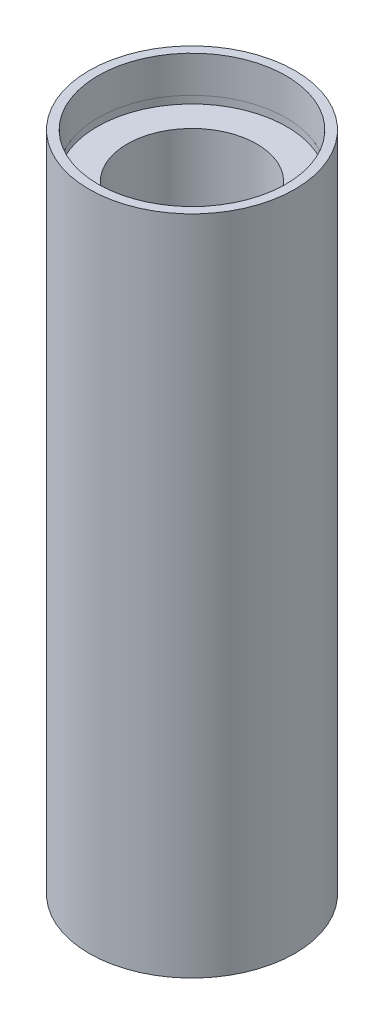
ISO-10303-21;
HEADER;
FILE_DESCRIPTION(('STEP AP214'),'2;1');
FILE_NAME('part.step','',(''),(''),'','','');
FILE_SCHEMA(('AUTOMOTIVE_DESIGN { 1 0 10303 214 1 1 1 1 }'));
ENDSEC;
DATA;
#1=APPLICATION_CONTEXT('core data for automotive mechanical design processes');
#2=APPLICATION_PROTOCOL_DEFINITION('international standard','automotive_design',2000,#1);
#3=PRODUCT_CONTEXT('',#1,'mechanical');
#4=PRODUCT('Part','Part','',(#3));
#5=PRODUCT_RELATED_PRODUCT_CATEGORY('part','',(#4));
#6=PRODUCT_DEFINITION_FORMATION('','',#4);
#7=PRODUCT_DEFINITION_CONTEXT('part definition',#1,'design');
#8=PRODUCT_DEFINITION('design','',#6,#7);
#9=PRODUCT_DEFINITION_SHAPE('','',#8);
#10=(LENGTH_UNIT() NAMED_UNIT(*) SI_UNIT(.MILLI.,.METRE.));
#11=(NAMED_UNIT(*) PLANE_ANGLE_UNIT() SI_UNIT($,.RADIAN.));
#12=(NAMED_UNIT(*) SI_UNIT($,.STERADIAN.) SOLID_ANGLE_UNIT());
#13=UNCERTAINTY_MEASURE_WITH_UNIT(LENGTH_MEASURE(1.E-05),#10,'distance_accuracy_value','');
#14=(GEOMETRIC_REPRESENTATION_CONTEXT(3) GLOBAL_UNCERTAINTY_ASSIGNED_CONTEXT((#13)) GLOBAL_UNIT_ASSIGNED_CONTEXT((#10,
#11,#12)) REPRESENTATION_CONTEXT('',''));
#15=CARTESIAN_POINT('',(0.,0.,0.));
#16=DIRECTION('',(0.,0.,1.));
#17=DIRECTION('',(1.,0.,0.));
#18=AXIS2_PLACEMENT_3D('',#15,#16,#17);
#19=CARTESIAN_POINT('',(11.1,0.,0.));
#20=DIRECTION('',(0.,1.,0.));
#21=DIRECTION('',(0.,0.,1.));
#22=AXIS2_PLACEMENT_3D('',#19,#20,#21);
#23=PLANE('',#22);
#24=CARTESIAN_POINT('',(0.,0.,0.));
#25=DIRECTION('',(0.,1.,0.));
#26=DIRECTION('',(0.,0.,1.));
#27=AXIS2_PLACEMENT_3D('',#24,#25,#26);
#28=CIRCLE('',#27,12.7);
#29=CARTESIAN_POINT('',(0.,0.,12.7));
#30=VERTEX_POINT('',#29);
#31=EDGE_CURVE('E10',#30,#30,#28,.T.);
#32=ORIENTED_EDGE('',*,*,#31,.F.);
#33=EDGE_LOOP('',(#32));
#34=FACE_BOUND('',#33,.T.);
#35=CARTESIAN_POINT('',(0.,0.,0.));
#36=DIRECTION('',(0.,1.,0.));
#37=DIRECTION('',(0.,0.,1.));
#38=AXIS2_PLACEMENT_3D('',#35,#36,#37);
#39=CIRCLE('',#38,11.1);
#40=CARTESIAN_POINT('',(0.,0.,11.1));
#41=VERTEX_POINT('',#40);
#42=EDGE_CURVE('E76',#41,#41,#39,.T.);
#43=ORIENTED_EDGE('',*,*,#42,.T.);
#44=EDGE_LOOP('',(#43));
#45=FACE_BOUND('',#44,.T.);
#46=ADVANCED_FACE('F36',(#34,#45),#23,.F.);
#47=CARTESIAN_POINT('',(0.,161.376166943427,0.));
#48=DIRECTION('',(0.,1.,0.));
#49=DIRECTION('',(0.,0.,1.));
#50=AXIS2_PLACEMENT_3D('',#47,#48,#49);
#51=CYLINDRICAL_SURFACE('',#50,12.7);
#52=CARTESIAN_POINT('',(0.,81.7,0.));
#53=DIRECTION('',(0.,1.,0.));
#54=DIRECTION('',(0.,0.,1.));
#55=AXIS2_PLACEMENT_3D('',#52,#53,#54);
#56=CIRCLE('',#55,12.7);
#57=CARTESIAN_POINT('',(0.,81.7,12.7));
#58=VERTEX_POINT('',#57);
#59=EDGE_CURVE('E42',#58,#58,#56,.T.);
#60=ORIENTED_EDGE('',*,*,#59,.F.);
#61=EDGE_LOOP('',(#60));
#62=FACE_BOUND('',#61,.T.);
#63=ORIENTED_EDGE('',*,*,#31,.T.);
#64=EDGE_LOOP('',(#63));
#65=FACE_BOUND('',#64,.T.);
#66=ADVANCED_FACE('F137',(#62,#65),#51,.T.);
#67=CARTESIAN_POINT('',(11.6,81.7,0.));
#68=DIRECTION('',(0.,-1.,0.));
#69=DIRECTION('',(0.,0.,-1.));
#70=AXIS2_PLACEMENT_3D('',#67,#68,#69);
#71=PLANE('',#70);
#72=CARTESIAN_POINT('',(0.,81.7,0.));
#73=DIRECTION('',(0.,1.,0.));
#74=DIRECTION('',(0.,0.,1.));
#75=AXIS2_PLACEMENT_3D('',#72,#73,#74);
#76=CIRCLE('',#75,11.6);
#77=CARTESIAN_POINT('',(0.,81.7,11.6));
#78=VERTEX_POINT('',#77);
#79=EDGE_CURVE('E46',#78,#78,#76,.T.);
#80=ORIENTED_EDGE('',*,*,#79,.F.);
#81=EDGE_LOOP('',(#80));
#82=FACE_BOUND('',#81,.T.);
#83=ORIENTED_EDGE('',*,*,#59,.T.);
#84=EDGE_LOOP('',(#83));
#85=FACE_BOUND('',#84,.T.);
#86=ADVANCED_FACE('F132',(#82,#85),#71,.F.);
#87=CARTESIAN_POINT('',(0.,161.376166943427,0.));
#88=DIRECTION('',(0.,1.,0.));
#89=DIRECTION('',(0.,0.,1.));
#90=AXIS2_PLACEMENT_3D('',#87,#88,#89);
#91=CYLINDRICAL_SURFACE('',#90,11.6);
#92=CARTESIAN_POINT('',(0.,77.2,0.));
#93=DIRECTION('',(0.,1.,0.));
#94=DIRECTION('',(0.,0.,1.));
#95=AXIS2_PLACEMENT_3D('',#92,#93,#94);
#96=CIRCLE('',#95,11.6);
#97=CARTESIAN_POINT('',(0.,77.2,11.6));
#98=VERTEX_POINT('',#97);
#99=EDGE_CURVE('E50',#98,#98,#96,.T.);
#100=ORIENTED_EDGE('',*,*,#99,.F.);
#101=EDGE_LOOP('',(#100));
#102=FACE_BOUND('',#101,.T.);
#103=ORIENTED_EDGE('',*,*,#79,.T.);
#104=EDGE_LOOP('',(#103));
#105=FACE_BOUND('',#104,.T.);
#106=ADVANCED_FACE('F126',(#102,#105),#91,.F.);
#107=CARTESIAN_POINT('',(11.6,77.2,0.));
#108=DIRECTION('',(0.,1.,0.));
#109=DIRECTION('',(0.,0.,1.));
#110=AXIS2_PLACEMENT_3D('',#107,#108,#109);
#111=PLANE('',#110);
#112=CARTESIAN_POINT('',(0.,77.2,0.));
#113=DIRECTION('',(0.,1.,0.));
#114=DIRECTION('',(0.,0.,1.));
#115=AXIS2_PLACEMENT_3D('',#112,#113,#114);
#116=CIRCLE('',#115,11.7);
#117=CARTESIAN_POINT('',(0.,77.2,11.7));
#118=VERTEX_POINT('',#117);
#119=EDGE_CURVE('E55',#118,#118,#116,.T.);
#120=ORIENTED_EDGE('',*,*,#119,.F.);
#121=EDGE_LOOP('',(#120));
#122=FACE_BOUND('',#121,.T.);
#123=ORIENTED_EDGE('',*,*,#99,.T.);
#124=EDGE_LOOP('',(#123));
#125=FACE_BOUND('',#124,.T.);
#126=ADVANCED_FACE('F120',(#122,#125),#111,.F.);
#127=CARTESIAN_POINT('',(0.,161.376166943427,0.));
#128=DIRECTION('',(0.,1.,0.));
#129=DIRECTION('',(0.,0.,1.));
#130=AXIS2_PLACEMENT_3D('',#127,#128,#129);
#131=CYLINDRICAL_SURFACE('',#130,11.7);
#132=CARTESIAN_POINT('',(0.,76.2,0.));
#133=DIRECTION('',(0.,1.,0.));
#134=DIRECTION('',(0.,0.,1.));
#135=AXIS2_PLACEMENT_3D('',#132,#133,#134);
#136=CIRCLE('',#135,11.7);
#137=CARTESIAN_POINT('',(0.,76.2,11.7));
#138=VERTEX_POINT('',#137);
#139=EDGE_CURVE('E58',#138,#138,#136,.T.);
#140=ORIENTED_EDGE('',*,*,#139,.F.);
#141=EDGE_LOOP('',(#140));
#142=FACE_BOUND('',#141,.T.);
#143=ORIENTED_EDGE('',*,*,#119,.T.);
#144=EDGE_LOOP('',(#143));
#145=FACE_BOUND('',#144,.T.);
#146=ADVANCED_FACE('F114',(#142,#145),#131,.F.);
#147=CARTESIAN_POINT('',(8.00000000000002,76.2,0.));
#148=DIRECTION('',(0.,-1.,0.));
#149=DIRECTION('',(0.,0.,-1.));
#150=AXIS2_PLACEMENT_3D('',#147,#148,#149);
#151=PLANE('',#150);
#152=CARTESIAN_POINT('',(0.,76.2,0.));
#153=DIRECTION('',(0.,1.,0.));
#154=DIRECTION('',(0.,0.,1.));
#155=AXIS2_PLACEMENT_3D('',#152,#153,#154);
#156=CIRCLE('',#155,8.00000000000002);
#157=CARTESIAN_POINT('',(0.,76.2,8.00000000000002));
#158=VERTEX_POINT('',#157);
#159=EDGE_CURVE('E61',#158,#158,#156,.T.);
#160=ORIENTED_EDGE('',*,*,#159,.F.);
#161=EDGE_LOOP('',(#160));
#162=FACE_BOUND('',#161,.T.);
#163=ORIENTED_EDGE('',*,*,#139,.T.);
#164=EDGE_LOOP('',(#163));
#165=FACE_BOUND('',#164,.T.);
#166=ADVANCED_FACE('F108',(#162,#165),#151,.F.);
#167=CARTESIAN_POINT('',(0.,161.376166943427,0.));
#168=DIRECTION('',(0.,1.,0.));
#169=DIRECTION('',(0.,0.,1.));
#170=AXIS2_PLACEMENT_3D('',#167,#168,#169);
#171=CYLINDRICAL_SURFACE('',#170,8.00000000000002);
#172=CARTESIAN_POINT('',(0.,5.49999999999998,0.));
#173=DIRECTION('',(0.,1.,0.));
#174=DIRECTION('',(0.,0.,1.));
#175=AXIS2_PLACEMENT_3D('',#172,#173,#174);
#176=CIRCLE('',#175,8.00000000000002);
#177=CARTESIAN_POINT('',(0.,5.49999999999998,8.00000000000002));
#178=VERTEX_POINT('',#177);
#179=EDGE_CURVE('E64',#178,#178,#176,.T.);
#180=ORIENTED_EDGE('',*,*,#179,.F.);
#181=EDGE_LOOP('',(#180));
#182=FACE_BOUND('',#181,.T.);
#183=ORIENTED_EDGE('',*,*,#159,.T.);
#184=EDGE_LOOP('',(#183));
#185=FACE_BOUND('',#184,.T.);
#186=ADVANCED_FACE('F102',(#182,#185),#171,.F.);
#187=CARTESIAN_POINT('',(11.7,5.49999999999999,0.));
#188=DIRECTION('',(0.,1.,0.));
#189=DIRECTION('',(0.,0.,1.));
#190=AXIS2_PLACEMENT_3D('',#187,#188,#189);
#191=PLANE('',#190);
#192=CARTESIAN_POINT('',(0.,5.49999999999998,0.));
#193=DIRECTION('',(0.,1.,0.));
#194=DIRECTION('',(0.,0.,1.));
#195=AXIS2_PLACEMENT_3D('',#192,#193,#194);
#196=CIRCLE('',#195,11.7);
#197=CARTESIAN_POINT('',(0.,5.49999999999998,11.7));
#198=VERTEX_POINT('',#197);
#199=EDGE_CURVE('E67',#198,#198,#196,.T.);
#200=ORIENTED_EDGE('',*,*,#199,.F.);
#201=EDGE_LOOP('',(#200));
#202=FACE_BOUND('',#201,.T.);
#203=ORIENTED_EDGE('',*,*,#179,.T.);
#204=EDGE_LOOP('',(#203));
#205=FACE_BOUND('',#204,.T.);
#206=ADVANCED_FACE('F96',(#202,#205),#191,.F.);
#207=CARTESIAN_POINT('',(0.,161.376166943427,0.));
#208=DIRECTION('',(0.,1.,0.));
#209=DIRECTION('',(0.,0.,1.));
#210=AXIS2_PLACEMENT_3D('',#207,#208,#209);
#211=CYLINDRICAL_SURFACE('',#210,11.7);
#212=CARTESIAN_POINT('',(0.,4.49999999999998,0.));
#213=DIRECTION('',(0.,1.,0.));
#214=DIRECTION('',(0.,0.,1.));
#215=AXIS2_PLACEMENT_3D('',#212,#213,#214);
#216=CIRCLE('',#215,11.7);
#217=CARTESIAN_POINT('',(0.,4.49999999999998,11.7));
#218=VERTEX_POINT('',#217);
#219=EDGE_CURVE('E70',#218,#218,#216,.T.);
#220=ORIENTED_EDGE('',*,*,#219,.F.);
#221=EDGE_LOOP('',(#220));
#222=FACE_BOUND('',#221,.T.);
#223=ORIENTED_EDGE('',*,*,#199,.T.);
#224=EDGE_LOOP('',(#223));
#225=FACE_BOUND('',#224,.T.);
#226=ADVANCED_FACE('F90',(#222,#225),#211,.F.);
#227=CARTESIAN_POINT('',(11.1,4.49999999999998,0.));
#228=DIRECTION('',(0.,-1.,0.));
#229=DIRECTION('',(0.,0.,-1.));
#230=AXIS2_PLACEMENT_3D('',#227,#228,#229);
#231=PLANE('',#230);
#232=CARTESIAN_POINT('',(0.,4.49999999999998,0.));
#233=DIRECTION('',(0.,1.,0.));
#234=DIRECTION('',(0.,0.,1.));
#235=AXIS2_PLACEMENT_3D('',#232,#233,#234);
#236=CIRCLE('',#235,11.1);
#237=CARTESIAN_POINT('',(0.,4.49999999999998,11.1));
#238=VERTEX_POINT('',#237);
#239=EDGE_CURVE('E73',#238,#238,#236,.T.);
#240=ORIENTED_EDGE('',*,*,#239,.F.);
#241=EDGE_LOOP('',(#240));
#242=FACE_BOUND('',#241,.T.);
#243=ORIENTED_EDGE('',*,*,#219,.T.);
#244=EDGE_LOOP('',(#243));
#245=FACE_BOUND('',#244,.T.);
#246=ADVANCED_FACE('F84',(#242,#245),#231,.F.);
#247=CARTESIAN_POINT('',(0.,161.376166943427,0.));
#248=DIRECTION('',(0.,1.,0.));
#249=DIRECTION('',(0.,0.,1.));
#250=AXIS2_PLACEMENT_3D('',#247,#248,#249);
#251=CYLINDRICAL_SURFACE('',#250,11.1);
#252=ORIENTED_EDGE('',*,*,#42,.F.);
#253=EDGE_LOOP('',(#252));
#254=FACE_BOUND('',#253,.T.);
#255=ORIENTED_EDGE('',*,*,#239,.T.);
#256=EDGE_LOOP('',(#255));
#257=FACE_BOUND('',#256,.T.);
#258=ADVANCED_FACE('F81',(#254,#257),#251,.F.);
#259=CLOSED_SHELL('',(#46,#66,#86,#106,#126,#146,#166,#186,#206,#226,#246,#258));
#260=MANIFOLD_SOLID_BREP('B2',#259);
#261=ADVANCED_BREP_SHAPE_REPRESENTATION('',(#18,#260),#14);
#262=SHAPE_DEFINITION_REPRESENTATION(#9,#261);
ENDSEC;
END-ISO-10303-21;
